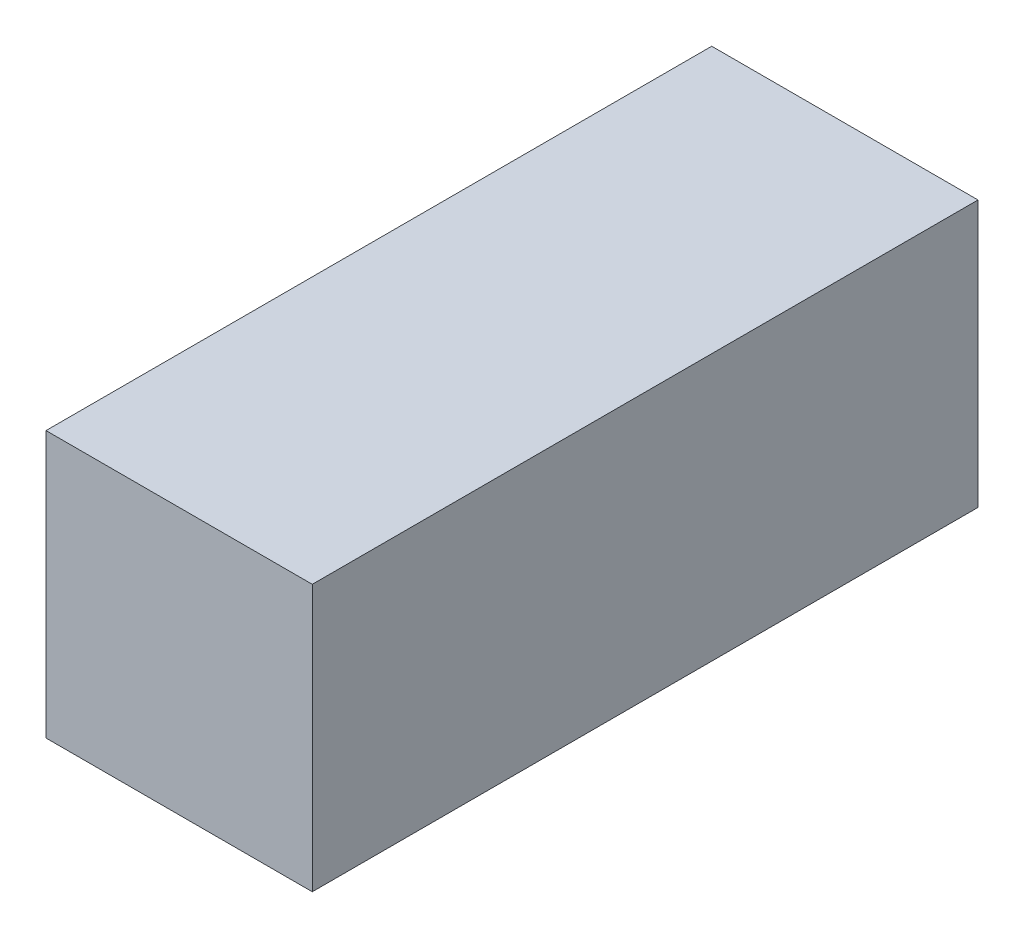
ISO-10303-21;
HEADER;
FILE_DESCRIPTION(('STEP AP214'),'2;1');
FILE_NAME('part.step','',(''),(''),'','','');
FILE_SCHEMA(('AUTOMOTIVE_DESIGN { 1 0 10303 214 1 1 1 1 }'));
ENDSEC;
DATA;
#1=APPLICATION_CONTEXT('core data for automotive mechanical design processes');
#2=APPLICATION_PROTOCOL_DEFINITION('international standard','automotive_design',2000,#1);
#3=PRODUCT_CONTEXT('',#1,'mechanical');
#4=PRODUCT('Part','Part','',(#3));
#5=PRODUCT_RELATED_PRODUCT_CATEGORY('part','',(#4));
#6=PRODUCT_DEFINITION_FORMATION('','',#4);
#7=PRODUCT_DEFINITION_CONTEXT('part definition',#1,'design');
#8=PRODUCT_DEFINITION('design','',#6,#7);
#9=PRODUCT_DEFINITION_SHAPE('','',#8);
#10=(LENGTH_UNIT() NAMED_UNIT(*) SI_UNIT(.MILLI.,.METRE.));
#11=(NAMED_UNIT(*) PLANE_ANGLE_UNIT() SI_UNIT($,.RADIAN.));
#12=(NAMED_UNIT(*) SI_UNIT($,.STERADIAN.) SOLID_ANGLE_UNIT());
#13=UNCERTAINTY_MEASURE_WITH_UNIT(LENGTH_MEASURE(1.E-05),#10,'distance_accuracy_value','');
#14=(GEOMETRIC_REPRESENTATION_CONTEXT(3) GLOBAL_UNCERTAINTY_ASSIGNED_CONTEXT((#13)) GLOBAL_UNIT_ASSIGNED_CONTEXT((#10,
#11,#12)) REPRESENTATION_CONTEXT('',''));
#15=CARTESIAN_POINT('',(0.,0.,0.));
#16=DIRECTION('',(0.,0.,1.));
#17=DIRECTION('',(1.,0.,0.));
#18=AXIS2_PLACEMENT_3D('',#15,#16,#17);
#19=CARTESIAN_POINT('',(0.,40.,0.));
#20=DIRECTION('',(1.,0.,0.));
#21=DIRECTION('',(0.,0.,-1.));
#22=AXIS2_PLACEMENT_3D('',#19,#20,#21);
#23=PLANE('',#22);
#24=DIRECTION('',(0.,0.,1.));
#25=VECTOR('',#24,1.);
#26=CARTESIAN_POINT('',(0.,0.,0.));
#27=LINE('',#26,#25);
#28=CARTESIAN_POINT('',(0.,0.,-100.));
#29=VERTEX_POINT('',#28);
#30=CARTESIAN_POINT('',(0.,0.,0.));
#31=VERTEX_POINT('',#30);
#32=EDGE_CURVE('E96',#29,#31,#27,.T.);
#33=ORIENTED_EDGE('',*,*,#32,.T.);
#34=DIRECTION('',(0.,-1.,0.));
#35=VECTOR('',#34,1.);
#36=CARTESIAN_POINT('',(0.,40.,0.));
#37=LINE('',#36,#35);
#38=CARTESIAN_POINT('',(0.,40.,0.));
#39=VERTEX_POINT('',#38);
#40=EDGE_CURVE('E11',#39,#31,#37,.T.);
#41=ORIENTED_EDGE('',*,*,#40,.F.);
#42=DIRECTION('',(0.,0.,1.));
#43=VECTOR('',#42,1.);
#44=CARTESIAN_POINT('',(0.,40.,0.));
#45=LINE('',#44,#43);
#46=CARTESIAN_POINT('',(0.,40.,-100.));
#47=VERTEX_POINT('',#46);
#48=EDGE_CURVE('E84',#47,#39,#45,.T.);
#49=ORIENTED_EDGE('',*,*,#48,.F.);
#50=DIRECTION('',(0.,-1.,0.));
#51=VECTOR('',#50,1.);
#52=CARTESIAN_POINT('',(0.,40.,-100.));
#53=LINE('',#52,#51);
#54=EDGE_CURVE('E92',#47,#29,#53,.T.);
#55=ORIENTED_EDGE('',*,*,#54,.T.);
#56=EDGE_LOOP('',(#33,#41,#49,#55));
#57=FACE_BOUND('',#56,.T.);
#58=ADVANCED_FACE('F33',(#57),#23,.F.);
#59=CARTESIAN_POINT('',(0.,40.,0.));
#60=DIRECTION('',(0.,0.,-1.));
#61=DIRECTION('',(-1.,0.,0.));
#62=AXIS2_PLACEMENT_3D('',#59,#60,#61);
#63=PLANE('',#62);
#64=DIRECTION('',(1.,0.,0.));
#65=VECTOR('',#64,1.);
#66=CARTESIAN_POINT('',(0.,0.,0.));
#67=LINE('',#66,#65);
#68=CARTESIAN_POINT('',(40.,0.,0.));
#69=VERTEX_POINT('',#68);
#70=EDGE_CURVE('E88',#31,#69,#67,.T.);
#71=ORIENTED_EDGE('',*,*,#70,.T.);
#72=DIRECTION('',(0.,-1.,0.));
#73=VECTOR('',#72,1.);
#74=CARTESIAN_POINT('',(40.,40.,0.));
#75=LINE('',#74,#73);
#76=CARTESIAN_POINT('',(40.,40.,0.));
#77=VERTEX_POINT('',#76);
#78=EDGE_CURVE('E41',#77,#69,#75,.T.);
#79=ORIENTED_EDGE('',*,*,#78,.F.);
#80=DIRECTION('',(1.,0.,0.));
#81=VECTOR('',#80,1.);
#82=CARTESIAN_POINT('',(0.,40.,0.));
#83=LINE('',#82,#81);
#84=EDGE_CURVE('E79',#39,#77,#83,.T.);
#85=ORIENTED_EDGE('',*,*,#84,.F.);
#86=ORIENTED_EDGE('',*,*,#40,.T.);
#87=EDGE_LOOP('',(#71,#79,#85,#86));
#88=FACE_BOUND('',#87,.T.);
#89=ADVANCED_FACE('F87',(#88),#63,.F.);
#90=CARTESIAN_POINT('',(40.,40.,0.));
#91=DIRECTION('',(-1.,0.,0.));
#92=DIRECTION('',(0.,0.,1.));
#93=AXIS2_PLACEMENT_3D('',#90,#91,#92);
#94=PLANE('',#93);
#95=DIRECTION('',(0.,0.,-1.));
#96=VECTOR('',#95,1.);
#97=CARTESIAN_POINT('',(40.,0.,0.));
#98=LINE('',#97,#96);
#99=CARTESIAN_POINT('',(40.,0.,-100.));
#100=VERTEX_POINT('',#99);
#101=EDGE_CURVE('E66',#69,#100,#98,.T.);
#102=ORIENTED_EDGE('',*,*,#101,.T.);
#103=DIRECTION('',(0.,-1.,0.));
#104=VECTOR('',#103,1.);
#105=CARTESIAN_POINT('',(40.,40.,-100.));
#106=LINE('',#105,#104);
#107=CARTESIAN_POINT('',(40.,40.,-100.));
#108=VERTEX_POINT('',#107);
#109=EDGE_CURVE('E89',#108,#100,#106,.T.);
#110=ORIENTED_EDGE('',*,*,#109,.F.);
#111=DIRECTION('',(0.,0.,-1.));
#112=VECTOR('',#111,1.);
#113=CARTESIAN_POINT('',(40.,40.,0.));
#114=LINE('',#113,#112);
#115=EDGE_CURVE('E82',#77,#108,#114,.T.);
#116=ORIENTED_EDGE('',*,*,#115,.F.);
#117=ORIENTED_EDGE('',*,*,#78,.T.);
#118=EDGE_LOOP('',(#102,#110,#116,#117));
#119=FACE_BOUND('',#118,.T.);
#120=ADVANCED_FACE('F90',(#119),#94,.F.);
#121=CARTESIAN_POINT('',(0.,40.,-100.));
#122=DIRECTION('',(0.,0.,1.));
#123=DIRECTION('',(1.,0.,0.));
#124=AXIS2_PLACEMENT_3D('',#121,#122,#123);
#125=PLANE('',#124);
#126=DIRECTION('',(-1.,0.,0.));
#127=VECTOR('',#126,1.);
#128=CARTESIAN_POINT('',(0.,0.,-100.));
#129=LINE('',#128,#127);
#130=EDGE_CURVE('E72',#100,#29,#129,.T.);
#131=ORIENTED_EDGE('',*,*,#130,.T.);
#132=ORIENTED_EDGE('',*,*,#54,.F.);
#133=DIRECTION('',(-1.,0.,0.));
#134=VECTOR('',#133,1.);
#135=CARTESIAN_POINT('',(0.,40.,-100.));
#136=LINE('',#135,#134);
#137=EDGE_CURVE('E49',#108,#47,#136,.T.);
#138=ORIENTED_EDGE('',*,*,#137,.F.);
#139=ORIENTED_EDGE('',*,*,#109,.T.);
#140=EDGE_LOOP('',(#131,#132,#138,#139));
#141=FACE_BOUND('',#140,.T.);
#142=ADVANCED_FACE('F103',(#141),#125,.F.);
#143=CARTESIAN_POINT('',(0.,40.,0.));
#144=DIRECTION('',(0.,-1.,0.));
#145=DIRECTION('',(0.,0.,-1.));
#146=AXIS2_PLACEMENT_3D('',#143,#144,#145);
#147=PLANE('',#146);
#148=ORIENTED_EDGE('',*,*,#48,.T.);
#149=ORIENTED_EDGE('',*,*,#84,.T.);
#150=ORIENTED_EDGE('',*,*,#115,.T.);
#151=ORIENTED_EDGE('',*,*,#137,.T.);
#152=EDGE_LOOP('',(#148,#149,#150,#151));
#153=FACE_BOUND('',#152,.T.);
#154=ADVANCED_FACE('F80',(#153),#147,.F.);
#155=CARTESIAN_POINT('',(0.,0.,0.));
#156=DIRECTION('',(0.,-1.,0.));
#157=DIRECTION('',(0.,0.,-1.));
#158=AXIS2_PLACEMENT_3D('',#155,#156,#157);
#159=PLANE('',#158);
#160=ORIENTED_EDGE('',*,*,#32,.F.);
#161=ORIENTED_EDGE('',*,*,#130,.F.);
#162=ORIENTED_EDGE('',*,*,#101,.F.);
#163=ORIENTED_EDGE('',*,*,#70,.F.);
#164=EDGE_LOOP('',(#160,#161,#162,#163));
#165=FACE_BOUND('',#164,.T.);
#166=ADVANCED_FACE('F106',(#165),#159,.T.);
#167=CLOSED_SHELL('',(#58,#89,#120,#142,#154,#166));
#168=MANIFOLD_SOLID_BREP('B2',#167);
#169=ADVANCED_BREP_SHAPE_REPRESENTATION('',(#18,#168),#14);
#170=SHAPE_DEFINITION_REPRESENTATION(#9,#169);
ENDSEC;
END-ISO-10303-21;
